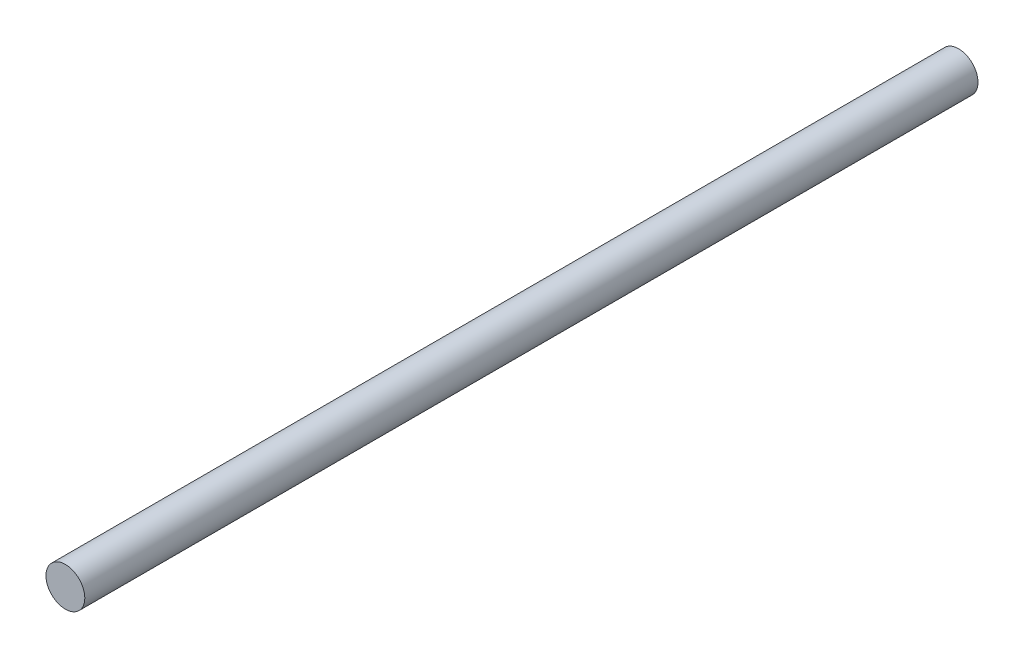
ISO-10303-21;
HEADER;
FILE_DESCRIPTION(('STEP AP214'),'2;1');
FILE_NAME('part.step','',(''),(''),'','','');
FILE_SCHEMA(('AUTOMOTIVE_DESIGN { 1 0 10303 214 1 1 1 1 }'));
ENDSEC;
DATA;
#1=APPLICATION_CONTEXT('core data for automotive mechanical design processes');
#2=APPLICATION_PROTOCOL_DEFINITION('international standard','automotive_design',2000,#1);
#3=PRODUCT_CONTEXT('',#1,'mechanical');
#4=PRODUCT('Part','Part','',(#3));
#5=PRODUCT_RELATED_PRODUCT_CATEGORY('part','',(#4));
#6=PRODUCT_DEFINITION_FORMATION('','',#4);
#7=PRODUCT_DEFINITION_CONTEXT('part definition',#1,'design');
#8=PRODUCT_DEFINITION('design','',#6,#7);
#9=PRODUCT_DEFINITION_SHAPE('','',#8);
#10=(LENGTH_UNIT() NAMED_UNIT(*) SI_UNIT(.MILLI.,.METRE.));
#11=(NAMED_UNIT(*) PLANE_ANGLE_UNIT() SI_UNIT($,.RADIAN.));
#12=(NAMED_UNIT(*) SI_UNIT($,.STERADIAN.) SOLID_ANGLE_UNIT());
#13=UNCERTAINTY_MEASURE_WITH_UNIT(LENGTH_MEASURE(1.E-05),#10,'distance_accuracy_value','');
#14=(GEOMETRIC_REPRESENTATION_CONTEXT(3) GLOBAL_UNCERTAINTY_ASSIGNED_CONTEXT((#13)) GLOBAL_UNIT_ASSIGNED_CONTEXT((#10,
#11,#12)) REPRESENTATION_CONTEXT('',''));
#15=CARTESIAN_POINT('',(0.,0.,0.));
#16=DIRECTION('',(0.,0.,1.));
#17=DIRECTION('',(1.,0.,0.));
#18=AXIS2_PLACEMENT_3D('',#15,#16,#17);
#19=CARTESIAN_POINT('',(0.,0.,230.));
#20=DIRECTION('',(0.,0.,-1.));
#21=DIRECTION('',(-1.,0.,0.));
#22=AXIS2_PLACEMENT_3D('',#19,#20,#21);
#23=CYLINDRICAL_SURFACE('',#22,5.);
#24=CARTESIAN_POINT('',(0.,0.,230.));
#25=DIRECTION('',(0.,0.,1.));
#26=DIRECTION('',(1.,0.,0.));
#27=AXIS2_PLACEMENT_3D('',#24,#25,#26);
#28=CIRCLE('',#27,5.);
#29=CARTESIAN_POINT('',(5.,0.,230.));
#30=VERTEX_POINT('',#29);
#31=EDGE_CURVE('E10',#30,#30,#28,.T.);
#32=ORIENTED_EDGE('',*,*,#31,.F.);
#33=EDGE_LOOP('',(#32));
#34=FACE_BOUND('',#33,.T.);
#35=CARTESIAN_POINT('',(0.,0.,0.));
#36=DIRECTION('',(0.,0.,1.));
#37=DIRECTION('',(1.,0.,0.));
#38=AXIS2_PLACEMENT_3D('',#35,#36,#37);
#39=CIRCLE('',#38,5.);
#40=CARTESIAN_POINT('',(5.,0.,0.));
#41=VERTEX_POINT('',#40);
#42=EDGE_CURVE('E36',#41,#41,#39,.T.);
#43=ORIENTED_EDGE('',*,*,#42,.T.);
#44=EDGE_LOOP('',(#43));
#45=FACE_BOUND('',#44,.T.);
#46=ADVANCED_FACE('F33',(#34,#45),#23,.T.);
#47=CARTESIAN_POINT('',(0.,0.,230.));
#48=DIRECTION('',(0.,0.,1.));
#49=DIRECTION('',(1.,0.,0.));
#50=AXIS2_PLACEMENT_3D('',#47,#48,#49);
#51=PLANE('',#50);
#52=ORIENTED_EDGE('',*,*,#31,.T.);
#53=EDGE_LOOP('',(#52));
#54=FACE_BOUND('',#53,.T.);
#55=ADVANCED_FACE('F48',(#54),#51,.T.);
#56=CARTESIAN_POINT('',(0.,0.,0.));
#57=DIRECTION('',(0.,0.,1.));
#58=DIRECTION('',(1.,0.,0.));
#59=AXIS2_PLACEMENT_3D('',#56,#57,#58);
#60=PLANE('',#59);
#61=ORIENTED_EDGE('',*,*,#42,.F.);
#62=EDGE_LOOP('',(#61));
#63=FACE_BOUND('',#62,.T.);
#64=ADVANCED_FACE('F46',(#63),#60,.F.);
#65=CLOSED_SHELL('',(#46,#55,#64));
#66=MANIFOLD_SOLID_BREP('B2',#65);
#67=ADVANCED_BREP_SHAPE_REPRESENTATION('',(#18,#66),#14);
#68=SHAPE_DEFINITION_REPRESENTATION(#9,#67);
ENDSEC;
END-ISO-10303-21;
